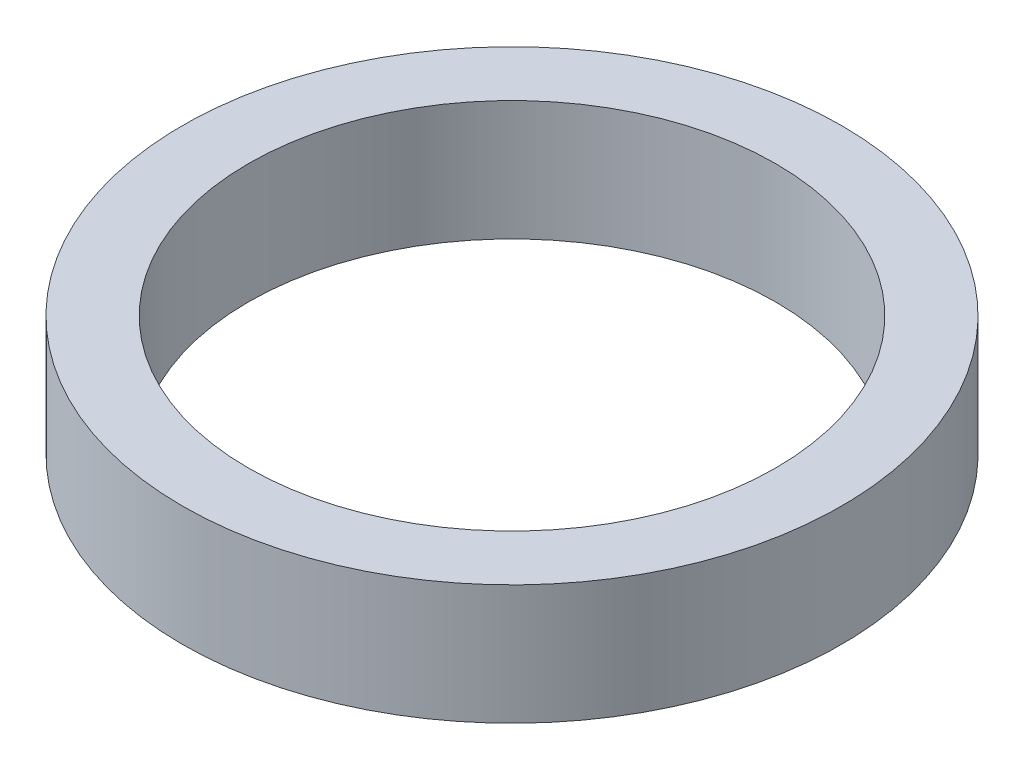
ISO-10303-21;
HEADER;
FILE_DESCRIPTION(('STEP AP214'),'2;1');
FILE_NAME('part.step','',(''),(''),'','','');
FILE_SCHEMA(('AUTOMOTIVE_DESIGN { 1 0 10303 214 1 1 1 1 }'));
ENDSEC;
DATA;
#1=APPLICATION_CONTEXT('core data for automotive mechanical design processes');
#2=APPLICATION_PROTOCOL_DEFINITION('international standard','automotive_design',2000,#1);
#3=PRODUCT_CONTEXT('',#1,'mechanical');
#4=PRODUCT('Part','Part','',(#3));
#5=PRODUCT_RELATED_PRODUCT_CATEGORY('part','',(#4));
#6=PRODUCT_DEFINITION_FORMATION('','',#4);
#7=PRODUCT_DEFINITION_CONTEXT('part definition',#1,'design');
#8=PRODUCT_DEFINITION('design','',#6,#7);
#9=PRODUCT_DEFINITION_SHAPE('','',#8);
#10=(LENGTH_UNIT() NAMED_UNIT(*) SI_UNIT(.MILLI.,.METRE.));
#11=(NAMED_UNIT(*) PLANE_ANGLE_UNIT() SI_UNIT($,.RADIAN.));
#12=(NAMED_UNIT(*) SI_UNIT($,.STERADIAN.) SOLID_ANGLE_UNIT());
#13=UNCERTAINTY_MEASURE_WITH_UNIT(LENGTH_MEASURE(1.E-05),#10,'distance_accuracy_value','');
#14=(GEOMETRIC_REPRESENTATION_CONTEXT(3) GLOBAL_UNCERTAINTY_ASSIGNED_CONTEXT((#13)) GLOBAL_UNIT_ASSIGNED_CONTEXT((#10,
#11,#12)) REPRESENTATION_CONTEXT('',''));
#15=CARTESIAN_POINT('',(0.,0.,0.));
#16=DIRECTION('',(0.,0.,1.));
#17=DIRECTION('',(1.,0.,0.));
#18=AXIS2_PLACEMENT_3D('',#15,#16,#17);
#19=CARTESIAN_POINT('',(0.,-10.,0.));
#20=DIRECTION('',(0.,1.,0.));
#21=DIRECTION('',(0.,0.,1.));
#22=AXIS2_PLACEMENT_3D('',#19,#20,#21);
#23=CYLINDRICAL_SURFACE('',#22,55.);
#24=CARTESIAN_POINT('',(0.,-10.,0.));
#25=DIRECTION('',(0.,1.,0.));
#26=DIRECTION('',(0.,0.,1.));
#27=AXIS2_PLACEMENT_3D('',#24,#25,#26);
#28=CIRCLE('',#27,55.);
#29=CARTESIAN_POINT('',(0.,-10.,55.));
#30=VERTEX_POINT('',#29);
#31=EDGE_CURVE('E10',#30,#30,#28,.T.);
#32=ORIENTED_EDGE('',*,*,#31,.T.);
#33=EDGE_LOOP('',(#32));
#34=FACE_BOUND('',#33,.T.);
#35=CARTESIAN_POINT('',(0.,10.,0.));
#36=DIRECTION('',(0.,1.,0.));
#37=DIRECTION('',(0.,0.,1.));
#38=AXIS2_PLACEMENT_3D('',#35,#36,#37);
#39=CIRCLE('',#38,55.);
#40=CARTESIAN_POINT('',(0.,10.,55.));
#41=VERTEX_POINT('',#40);
#42=EDGE_CURVE('E41',#41,#41,#39,.T.);
#43=ORIENTED_EDGE('',*,*,#42,.F.);
#44=EDGE_LOOP('',(#43));
#45=FACE_BOUND('',#44,.T.);
#46=ADVANCED_FACE('F31',(#34,#45),#23,.T.);
#47=CARTESIAN_POINT('',(0.,-10.,0.));
#48=DIRECTION('',(0.,1.,0.));
#49=DIRECTION('',(0.,0.,1.));
#50=AXIS2_PLACEMENT_3D('',#47,#48,#49);
#51=PLANE('',#50);
#52=CARTESIAN_POINT('',(0.,-10.,0.));
#53=DIRECTION('',(0.,1.,0.));
#54=DIRECTION('',(0.,0.,1.));
#55=AXIS2_PLACEMENT_3D('',#52,#53,#54);
#56=CIRCLE('',#55,44.);
#57=CARTESIAN_POINT('',(0.,-10.,44.));
#58=VERTEX_POINT('',#57);
#59=EDGE_CURVE('E37',#58,#58,#56,.T.);
#60=ORIENTED_EDGE('',*,*,#59,.T.);
#61=EDGE_LOOP('',(#60));
#62=FACE_BOUND('',#61,.T.);
#63=ORIENTED_EDGE('',*,*,#31,.F.);
#64=EDGE_LOOP('',(#63));
#65=FACE_BOUND('',#64,.T.);
#66=ADVANCED_FACE('F60',(#62,#65),#51,.F.);
#67=CARTESIAN_POINT('',(0.,-10.,0.));
#68=DIRECTION('',(0.,1.,0.));
#69=DIRECTION('',(0.,0.,1.));
#70=AXIS2_PLACEMENT_3D('',#67,#68,#69);
#71=CYLINDRICAL_SURFACE('',#70,44.);
#72=ORIENTED_EDGE('',*,*,#59,.F.);
#73=EDGE_LOOP('',(#72));
#74=FACE_BOUND('',#73,.T.);
#75=CARTESIAN_POINT('',(0.,10.,0.));
#76=DIRECTION('',(0.,1.,0.));
#77=DIRECTION('',(0.,0.,1.));
#78=AXIS2_PLACEMENT_3D('',#75,#76,#77);
#79=CIRCLE('',#78,44.);
#80=CARTESIAN_POINT('',(0.,10.,44.));
#81=VERTEX_POINT('',#80);
#82=EDGE_CURVE('E45',#81,#81,#79,.T.);
#83=ORIENTED_EDGE('',*,*,#82,.T.);
#84=EDGE_LOOP('',(#83));
#85=FACE_BOUND('',#84,.T.);
#86=ADVANCED_FACE('F51',(#74,#85),#71,.F.);
#87=CARTESIAN_POINT('',(0.,10.,0.));
#88=DIRECTION('',(0.,1.,0.));
#89=DIRECTION('',(0.,0.,1.));
#90=AXIS2_PLACEMENT_3D('',#87,#88,#89);
#91=PLANE('',#90);
#92=ORIENTED_EDGE('',*,*,#42,.T.);
#93=EDGE_LOOP('',(#92));
#94=FACE_BOUND('',#93,.T.);
#95=ORIENTED_EDGE('',*,*,#82,.F.);
#96=EDGE_LOOP('',(#95));
#97=FACE_BOUND('',#96,.T.);
#98=ADVANCED_FACE('F53',(#94,#97),#91,.T.);
#99=CLOSED_SHELL('',(#46,#66,#86,#98));
#100=MANIFOLD_SOLID_BREP('B2',#99);
#101=ADVANCED_BREP_SHAPE_REPRESENTATION('',(#18,#100),#14);
#102=SHAPE_DEFINITION_REPRESENTATION(#9,#101);
ENDSEC;
END-ISO-10303-21;
